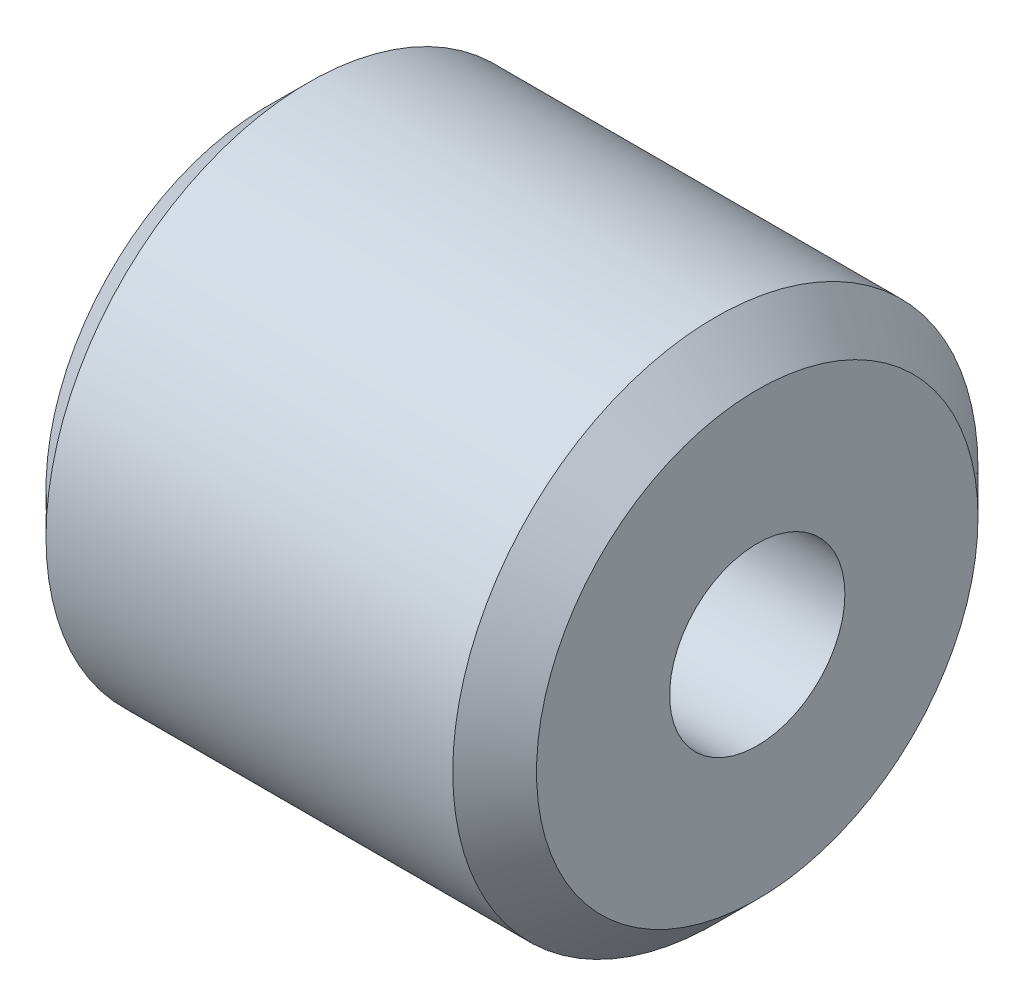
ISO-10303-21;
HEADER;
FILE_DESCRIPTION(('STEP AP214'),'2;1');
FILE_NAME('part.step','',(''),(''),'','','');
FILE_SCHEMA(('AUTOMOTIVE_DESIGN { 1 0 10303 214 1 1 1 1 }'));
ENDSEC;
DATA;
#1=APPLICATION_CONTEXT('core data for automotive mechanical design processes');
#2=APPLICATION_PROTOCOL_DEFINITION('international standard','automotive_design',2000,#1);
#3=PRODUCT_CONTEXT('',#1,'mechanical');
#4=PRODUCT('Part','Part','',(#3));
#5=PRODUCT_RELATED_PRODUCT_CATEGORY('part','',(#4));
#6=PRODUCT_DEFINITION_FORMATION('','',#4);
#7=PRODUCT_DEFINITION_CONTEXT('part definition',#1,'design');
#8=PRODUCT_DEFINITION('design','',#6,#7);
#9=PRODUCT_DEFINITION_SHAPE('','',#8);
#10=(LENGTH_UNIT() NAMED_UNIT(*) SI_UNIT(.MILLI.,.METRE.));
#11=(NAMED_UNIT(*) PLANE_ANGLE_UNIT() SI_UNIT($,.RADIAN.));
#12=(NAMED_UNIT(*) SI_UNIT($,.STERADIAN.) SOLID_ANGLE_UNIT());
#13=UNCERTAINTY_MEASURE_WITH_UNIT(LENGTH_MEASURE(1.E-05),#10,'distance_accuracy_value','');
#14=(GEOMETRIC_REPRESENTATION_CONTEXT(3) GLOBAL_UNCERTAINTY_ASSIGNED_CONTEXT((#13)) GLOBAL_UNIT_ASSIGNED_CONTEXT((#10,
#11,#12)) REPRESENTATION_CONTEXT('',''));
#15=CARTESIAN_POINT('',(0.,0.,0.));
#16=DIRECTION('',(0.,0.,1.));
#17=DIRECTION('',(1.,0.,0.));
#18=AXIS2_PLACEMENT_3D('',#15,#16,#17);
#19=CARTESIAN_POINT('',(4.45,0.,0.));
#20=DIRECTION('',(1.,0.,0.));
#21=DIRECTION('',(0.,0.,-1.));
#22=AXIS2_PLACEMENT_3D('',#19,#20,#21);
#23=PLANE('',#22);
#24=CARTESIAN_POINT('',(4.45,0.,0.));
#25=DIRECTION('',(1.,0.,0.));
#26=DIRECTION('',(0.,0.,-1.));
#27=AXIS2_PLACEMENT_3D('',#24,#25,#26);
#28=CIRCLE('',#27,4.005);
#29=CARTESIAN_POINT('',(4.45,0.,-4.005));
#30=VERTEX_POINT('',#29);
#31=EDGE_CURVE('E10',#30,#30,#28,.T.);
#32=ORIENTED_EDGE('',*,*,#31,.T.);
#33=EDGE_LOOP('',(#32));
#34=FACE_BOUND('',#33,.T.);
#35=CARTESIAN_POINT('',(4.45,0.,0.));
#36=DIRECTION('',(1.,0.,0.));
#37=DIRECTION('',(0.,0.,-1.));
#38=AXIS2_PLACEMENT_3D('',#35,#36,#37);
#39=CIRCLE('',#38,1.59);
#40=CARTESIAN_POINT('',(4.45,0.,-1.59));
#41=VERTEX_POINT('',#40);
#42=EDGE_CURVE('E51',#41,#41,#39,.T.);
#43=ORIENTED_EDGE('',*,*,#42,.F.);
#44=EDGE_LOOP('',(#43));
#45=FACE_BOUND('',#44,.T.);
#46=ADVANCED_FACE('F31',(#34,#45),#23,.T.);
#47=CARTESIAN_POINT('',(-4.45,0.,0.));
#48=DIRECTION('',(1.,0.,0.));
#49=DIRECTION('',(0.,0.,-1.));
#50=AXIS2_PLACEMENT_3D('',#47,#48,#49);
#51=PLANE('',#50);
#52=CARTESIAN_POINT('',(-4.45,0.,0.));
#53=DIRECTION('',(1.,0.,0.));
#54=DIRECTION('',(0.,0.,-1.));
#55=AXIS2_PLACEMENT_3D('',#52,#53,#54);
#56=CIRCLE('',#55,4.00499999999999);
#57=CARTESIAN_POINT('',(-4.45,0.,-4.00499999999999));
#58=VERTEX_POINT('',#57);
#59=EDGE_CURVE('E38',#58,#58,#56,.F.);
#60=ORIENTED_EDGE('',*,*,#59,.T.);
#61=EDGE_LOOP('',(#60));
#62=FACE_BOUND('',#61,.T.);
#63=CARTESIAN_POINT('',(-4.45,0.,0.));
#64=DIRECTION('',(1.,0.,0.));
#65=DIRECTION('',(0.,0.,-1.));
#66=AXIS2_PLACEMENT_3D('',#63,#64,#65);
#67=CIRCLE('',#66,1.59);
#68=CARTESIAN_POINT('',(-4.45,0.,-1.59));
#69=VERTEX_POINT('',#68);
#70=EDGE_CURVE('E52',#69,#69,#67,.T.);
#71=ORIENTED_EDGE('',*,*,#70,.T.);
#72=EDGE_LOOP('',(#71));
#73=FACE_BOUND('',#72,.T.);
#74=ADVANCED_FACE('F62',(#62,#73),#51,.F.);
#75=CARTESIAN_POINT('',(4.45,0.,0.));
#76=DIRECTION('',(-1.,0.,0.));
#77=DIRECTION('',(0.,0.,1.));
#78=AXIS2_PLACEMENT_3D('',#75,#76,#77);
#79=CYLINDRICAL_SURFACE('',#78,4.765);
#80=CARTESIAN_POINT('',(-3.69,0.,0.));
#81=DIRECTION('',(1.,0.,0.));
#82=DIRECTION('',(0.,0.,-1.));
#83=AXIS2_PLACEMENT_3D('',#80,#81,#82);
#84=CIRCLE('',#83,4.765);
#85=CARTESIAN_POINT('',(-3.69,0.,-4.765));
#86=VERTEX_POINT('',#85);
#87=EDGE_CURVE('E42',#86,#86,#84,.T.);
#88=ORIENTED_EDGE('',*,*,#87,.T.);
#89=EDGE_LOOP('',(#88));
#90=FACE_BOUND('',#89,.T.);
#91=CARTESIAN_POINT('',(3.69,0.,0.));
#92=DIRECTION('',(1.,0.,0.));
#93=DIRECTION('',(0.,0.,-1.));
#94=AXIS2_PLACEMENT_3D('',#91,#92,#93);
#95=CIRCLE('',#94,4.765);
#96=CARTESIAN_POINT('',(3.69,0.,-4.765));
#97=VERTEX_POINT('',#96);
#98=EDGE_CURVE('E46',#97,#97,#95,.F.);
#99=ORIENTED_EDGE('',*,*,#98,.T.);
#100=EDGE_LOOP('',(#99));
#101=FACE_BOUND('',#100,.T.);
#102=ADVANCED_FACE('F67',(#90,#101),#79,.T.);
#103=CARTESIAN_POINT('',(4.45,0.,0.));
#104=DIRECTION('',(-1.,0.,0.));
#105=DIRECTION('',(0.,0.,1.));
#106=AXIS2_PLACEMENT_3D('',#103,#104,#105);
#107=CYLINDRICAL_SURFACE('',#106,1.59);
#108=ORIENTED_EDGE('',*,*,#42,.T.);
#109=EDGE_LOOP('',(#108));
#110=FACE_BOUND('',#109,.T.);
#111=ORIENTED_EDGE('',*,*,#70,.F.);
#112=EDGE_LOOP('',(#111));
#113=FACE_BOUND('',#112,.T.);
#114=ADVANCED_FACE('F58',(#110,#113),#107,.F.);
#115=CARTESIAN_POINT('',(-3.69,0.,0.));
#116=DIRECTION('',(1.,0.,0.));
#117=DIRECTION('',(0.,0.,-1.));
#118=AXIS2_PLACEMENT_3D('',#115,#116,#117);
#119=CONICAL_SURFACE('',#118,4.765,0.78539816339745);
#120=ORIENTED_EDGE('',*,*,#59,.F.);
#121=EDGE_LOOP('',(#120));
#122=FACE_BOUND('',#121,.T.);
#123=ORIENTED_EDGE('',*,*,#87,.F.);
#124=EDGE_LOOP('',(#123));
#125=FACE_BOUND('',#124,.T.);
#126=ADVANCED_FACE('F73',(#122,#125),#119,.T.);
#127=CARTESIAN_POINT('',(4.45,0.,0.));
#128=DIRECTION('',(-1.,0.,0.));
#129=DIRECTION('',(0.,0.,1.));
#130=AXIS2_PLACEMENT_3D('',#127,#128,#129);
#131=CONICAL_SURFACE('',#130,4.005,0.785398163397447);
#132=ORIENTED_EDGE('',*,*,#98,.F.);
#133=EDGE_LOOP('',(#132));
#134=FACE_BOUND('',#133,.T.);
#135=ORIENTED_EDGE('',*,*,#31,.F.);
#136=EDGE_LOOP('',(#135));
#137=FACE_BOUND('',#136,.T.);
#138=ADVANCED_FACE('F33',(#134,#137),#131,.T.);
#139=CLOSED_SHELL('',(#46,#74,#102,#114,#126,#138));
#140=MANIFOLD_SOLID_BREP('B2',#139);
#141=ADVANCED_BREP_SHAPE_REPRESENTATION('',(#18,#140),#14);
#142=SHAPE_DEFINITION_REPRESENTATION(#9,#141);
ENDSEC;
END-ISO-10303-21;
